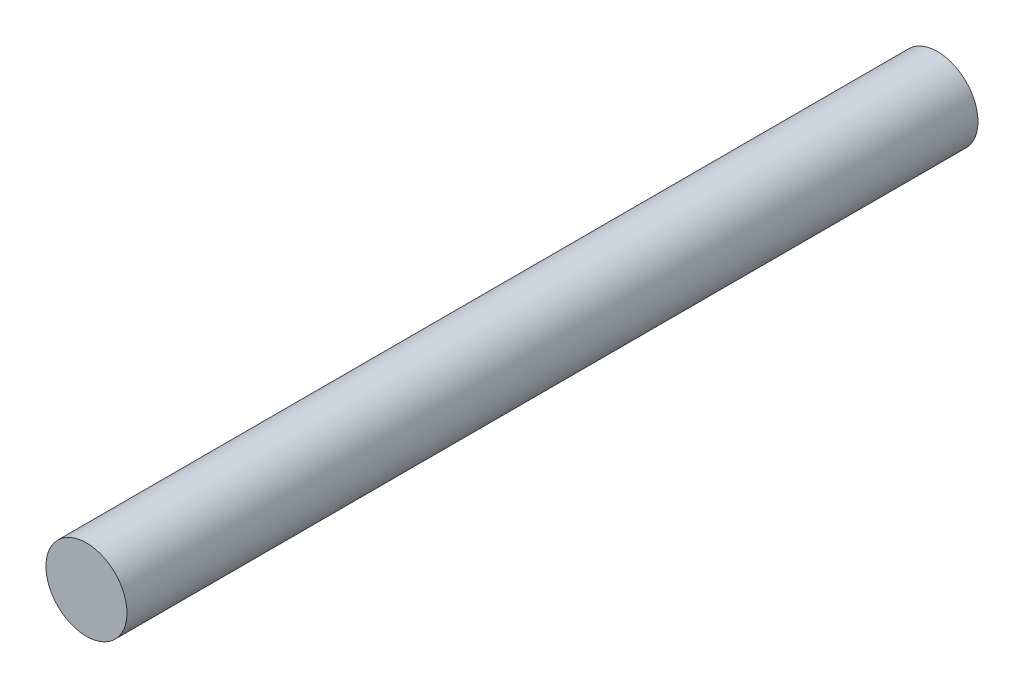
ISO-10303-21;
HEADER;
FILE_DESCRIPTION(('STEP AP214'),'2;1');
FILE_NAME('part.step','',(''),(''),'','','');
FILE_SCHEMA(('AUTOMOTIVE_DESIGN { 1 0 10303 214 1 1 1 1 }'));
ENDSEC;
DATA;
#1=APPLICATION_CONTEXT('core data for automotive mechanical design processes');
#2=APPLICATION_PROTOCOL_DEFINITION('international standard','automotive_design',2000,#1);
#3=PRODUCT_CONTEXT('',#1,'mechanical');
#4=PRODUCT('Part','Part','',(#3));
#5=PRODUCT_RELATED_PRODUCT_CATEGORY('part','',(#4));
#6=PRODUCT_DEFINITION_FORMATION('','',#4);
#7=PRODUCT_DEFINITION_CONTEXT('part definition',#1,'design');
#8=PRODUCT_DEFINITION('design','',#6,#7);
#9=PRODUCT_DEFINITION_SHAPE('','',#8);
#10=(LENGTH_UNIT() NAMED_UNIT(*) SI_UNIT(.MILLI.,.METRE.));
#11=(NAMED_UNIT(*) PLANE_ANGLE_UNIT() SI_UNIT($,.RADIAN.));
#12=(NAMED_UNIT(*) SI_UNIT($,.STERADIAN.) SOLID_ANGLE_UNIT());
#13=UNCERTAINTY_MEASURE_WITH_UNIT(LENGTH_MEASURE(1.E-05),#10,'distance_accuracy_value','');
#14=(GEOMETRIC_REPRESENTATION_CONTEXT(3) GLOBAL_UNCERTAINTY_ASSIGNED_CONTEXT((#13)) GLOBAL_UNIT_ASSIGNED_CONTEXT((#10,
#11,#12)) REPRESENTATION_CONTEXT('',''));
#15=CARTESIAN_POINT('',(0.,0.,0.));
#16=DIRECTION('',(0.,0.,1.));
#17=DIRECTION('',(1.,0.,0.));
#18=AXIS2_PLACEMENT_3D('',#15,#16,#17);
#19=CARTESIAN_POINT('',(0.,0.,0.));
#20=DIRECTION('',(0.,0.,1.));
#21=DIRECTION('',(1.,0.,0.));
#22=AXIS2_PLACEMENT_3D('',#19,#20,#21);
#23=CYLINDRICAL_SURFACE('',#22,1.);
#24=CARTESIAN_POINT('',(0.,0.,0.));
#25=DIRECTION('',(0.,0.,1.));
#26=DIRECTION('',(1.,0.,0.));
#27=AXIS2_PLACEMENT_3D('',#24,#25,#26);
#28=CIRCLE('',#27,1.);
#29=CARTESIAN_POINT('',(1.,0.,0.));
#30=VERTEX_POINT('',#29);
#31=EDGE_CURVE('E10',#30,#30,#28,.T.);
#32=ORIENTED_EDGE('',*,*,#31,.T.);
#33=EDGE_LOOP('',(#32));
#34=FACE_BOUND('',#33,.T.);
#35=CARTESIAN_POINT('',(0.,0.,21.));
#36=DIRECTION('',(0.,0.,1.));
#37=DIRECTION('',(1.,0.,0.));
#38=AXIS2_PLACEMENT_3D('',#35,#36,#37);
#39=CIRCLE('',#38,1.);
#40=CARTESIAN_POINT('',(1.,0.,21.));
#41=VERTEX_POINT('',#40);
#42=EDGE_CURVE('E37',#41,#41,#39,.T.);
#43=ORIENTED_EDGE('',*,*,#42,.F.);
#44=EDGE_LOOP('',(#43));
#45=FACE_BOUND('',#44,.T.);
#46=ADVANCED_FACE('F31',(#34,#45),#23,.T.);
#47=CARTESIAN_POINT('',(1.,0.,0.));
#48=DIRECTION('',(0.,0.,-1.));
#49=DIRECTION('',(-1.,0.,0.));
#50=AXIS2_PLACEMENT_3D('',#47,#48,#49);
#51=PLANE('',#50);
#52=ORIENTED_EDGE('',*,*,#31,.F.);
#53=EDGE_LOOP('',(#52));
#54=FACE_BOUND('',#53,.T.);
#55=ADVANCED_FACE('F46',(#54),#51,.T.);
#56=CARTESIAN_POINT('',(0.,0.,21.));
#57=DIRECTION('',(0.,0.,1.));
#58=DIRECTION('',(1.,0.,0.));
#59=AXIS2_PLACEMENT_3D('',#56,#57,#58);
#60=PLANE('',#59);
#61=ORIENTED_EDGE('',*,*,#42,.T.);
#62=EDGE_LOOP('',(#61));
#63=FACE_BOUND('',#62,.T.);
#64=ADVANCED_FACE('F43',(#63),#60,.T.);
#65=CLOSED_SHELL('',(#46,#55,#64));
#66=MANIFOLD_SOLID_BREP('B2',#65);
#67=ADVANCED_BREP_SHAPE_REPRESENTATION('',(#18,#66),#14);
#68=SHAPE_DEFINITION_REPRESENTATION(#9,#67);
ENDSEC;
END-ISO-10303-21;
